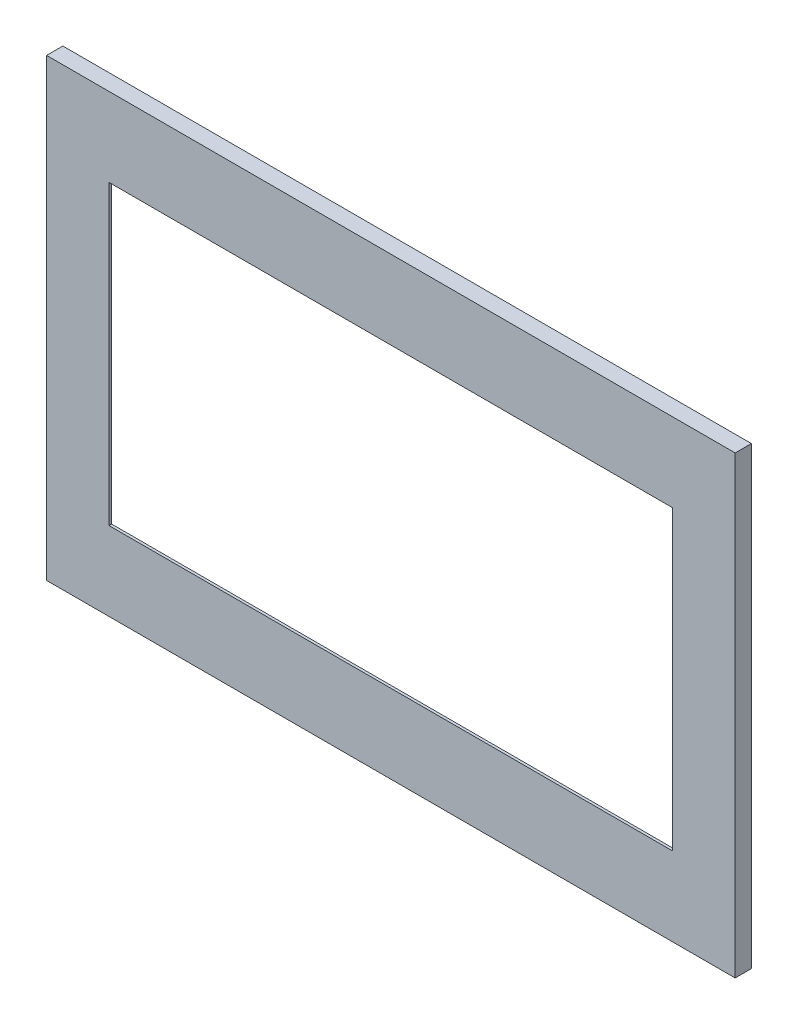
ISO-10303-21;
HEADER;
FILE_DESCRIPTION(('STEP AP214'),'2;1');
FILE_NAME('part.step','',(''),(''),'','','');
FILE_SCHEMA(('AUTOMOTIVE_DESIGN { 1 0 10303 214 1 1 1 1 }'));
ENDSEC;
DATA;
#1=APPLICATION_CONTEXT('core data for automotive mechanical design processes');
#2=APPLICATION_PROTOCOL_DEFINITION('international standard','automotive_design',2000,#1);
#3=PRODUCT_CONTEXT('',#1,'mechanical');
#4=PRODUCT('Part','Part','',(#3));
#5=PRODUCT_RELATED_PRODUCT_CATEGORY('part','',(#4));
#6=PRODUCT_DEFINITION_FORMATION('','',#4);
#7=PRODUCT_DEFINITION_CONTEXT('part definition',#1,'design');
#8=PRODUCT_DEFINITION('design','',#6,#7);
#9=PRODUCT_DEFINITION_SHAPE('','',#8);
#10=(LENGTH_UNIT() NAMED_UNIT(*) SI_UNIT(.MILLI.,.METRE.));
#11=(NAMED_UNIT(*) PLANE_ANGLE_UNIT() SI_UNIT($,.RADIAN.));
#12=(NAMED_UNIT(*) SI_UNIT($,.STERADIAN.) SOLID_ANGLE_UNIT());
#13=UNCERTAINTY_MEASURE_WITH_UNIT(LENGTH_MEASURE(1.E-05),#10,'distance_accuracy_value','');
#14=(GEOMETRIC_REPRESENTATION_CONTEXT(3) GLOBAL_UNCERTAINTY_ASSIGNED_CONTEXT((#13)) GLOBAL_UNIT_ASSIGNED_CONTEXT((#10,
#11,#12)) REPRESENTATION_CONTEXT('',''));
#15=CARTESIAN_POINT('',(0.,0.,0.));
#16=DIRECTION('',(0.,0.,1.));
#17=DIRECTION('',(1.,0.,0.));
#18=AXIS2_PLACEMENT_3D('',#15,#16,#17);
#19=CARTESIAN_POINT('',(-336.55,222.25,7.9375));
#20=DIRECTION('',(1.,0.,0.));
#21=DIRECTION('',(0.,1.,0.));
#22=AXIS2_PLACEMENT_3D('',#19,#20,#21);
#23=PLANE('',#22);
#24=DIRECTION('',(0.,-1.,0.));
#25=VECTOR('',#24,1.);
#26=CARTESIAN_POINT('',(-336.55,222.25,-7.9375));
#27=LINE('',#26,#25);
#28=CARTESIAN_POINT('',(-336.55,222.25,-7.9375));
#29=VERTEX_POINT('',#28);
#30=CARTESIAN_POINT('',(-336.55,-222.25,-7.9375));
#31=VERTEX_POINT('',#30);
#32=EDGE_CURVE('E186',#29,#31,#27,.T.);
#33=ORIENTED_EDGE('',*,*,#32,.T.);
#34=DIRECTION('',(0.,0.,-1.));
#35=VECTOR('',#34,1.);
#36=CARTESIAN_POINT('',(-336.55,-222.25,7.9375));
#37=LINE('',#36,#35);
#38=CARTESIAN_POINT('',(-336.55,-222.25,7.9375));
#39=VERTEX_POINT('',#38);
#40=EDGE_CURVE('E11',#39,#31,#37,.T.);
#41=ORIENTED_EDGE('',*,*,#40,.F.);
#42=DIRECTION('',(0.,-1.,0.));
#43=VECTOR('',#42,1.);
#44=CARTESIAN_POINT('',(-336.55,222.25,7.9375));
#45=LINE('',#44,#43);
#46=CARTESIAN_POINT('',(-336.55,222.25,7.9375));
#47=VERTEX_POINT('',#46);
#48=EDGE_CURVE('E194',#47,#39,#45,.T.);
#49=ORIENTED_EDGE('',*,*,#48,.F.);
#50=DIRECTION('',(0.,0.,-1.));
#51=VECTOR('',#50,1.);
#52=CARTESIAN_POINT('',(-336.55,222.25,7.9375));
#53=LINE('',#52,#51);
#54=EDGE_CURVE('E204',#47,#29,#53,.T.);
#55=ORIENTED_EDGE('',*,*,#54,.T.);
#56=EDGE_LOOP('',(#33,#41,#49,#55));
#57=FACE_BOUND('',#56,.T.);
#58=ADVANCED_FACE('F32',(#57),#23,.F.);
#59=CARTESIAN_POINT('',(336.55,-222.25,7.9375));
#60=DIRECTION('',(0.,1.,0.));
#61=DIRECTION('',(-1.,0.,0.));
#62=AXIS2_PLACEMENT_3D('',#59,#60,#61);
#63=PLANE('',#62);
#64=DIRECTION('',(1.,0.,0.));
#65=VECTOR('',#64,1.);
#66=CARTESIAN_POINT('',(336.55,-222.25,-7.9375));
#67=LINE('',#66,#65);
#68=CARTESIAN_POINT('',(336.55,-222.25,-7.9375));
#69=VERTEX_POINT('',#68);
#70=EDGE_CURVE('E207',#31,#69,#67,.T.);
#71=ORIENTED_EDGE('',*,*,#70,.T.);
#72=DIRECTION('',(0.,0.,-1.));
#73=VECTOR('',#72,1.);
#74=CARTESIAN_POINT('',(336.55,-222.25,7.9375));
#75=LINE('',#74,#73);
#76=CARTESIAN_POINT('',(336.55,-222.25,7.9375));
#77=VERTEX_POINT('',#76);
#78=EDGE_CURVE('E39',#77,#69,#75,.T.);
#79=ORIENTED_EDGE('',*,*,#78,.F.);
#80=DIRECTION('',(1.,0.,0.));
#81=VECTOR('',#80,1.);
#82=CARTESIAN_POINT('',(336.55,-222.25,7.9375));
#83=LINE('',#82,#81);
#84=EDGE_CURVE('E197',#39,#77,#83,.T.);
#85=ORIENTED_EDGE('',*,*,#84,.F.);
#86=ORIENTED_EDGE('',*,*,#40,.T.);
#87=EDGE_LOOP('',(#71,#79,#85,#86));
#88=FACE_BOUND('',#87,.T.);
#89=ADVANCED_FACE('F238',(#88),#63,.F.);
#90=CARTESIAN_POINT('',(336.55,222.25,7.9375));
#91=DIRECTION('',(-1.,0.,0.));
#92=DIRECTION('',(0.,-1.,0.));
#93=AXIS2_PLACEMENT_3D('',#90,#91,#92);
#94=PLANE('',#93);
#95=DIRECTION('',(0.,1.,0.));
#96=VECTOR('',#95,1.);
#97=CARTESIAN_POINT('',(336.55,222.25,-7.9375));
#98=LINE('',#97,#96);
#99=CARTESIAN_POINT('',(336.55,222.25,-7.9375));
#100=VERTEX_POINT('',#99);
#101=EDGE_CURVE('E209',#69,#100,#98,.T.);
#102=ORIENTED_EDGE('',*,*,#101,.T.);
#103=DIRECTION('',(0.,0.,-1.));
#104=VECTOR('',#103,1.);
#105=CARTESIAN_POINT('',(336.55,222.25,7.9375));
#106=LINE('',#105,#104);
#107=CARTESIAN_POINT('',(336.55,222.25,7.9375));
#108=VERTEX_POINT('',#107);
#109=EDGE_CURVE('E214',#108,#100,#106,.T.);
#110=ORIENTED_EDGE('',*,*,#109,.F.);
#111=DIRECTION('',(0.,1.,0.));
#112=VECTOR('',#111,1.);
#113=CARTESIAN_POINT('',(336.55,222.25,7.9375));
#114=LINE('',#113,#112);
#115=EDGE_CURVE('E200',#77,#108,#114,.T.);
#116=ORIENTED_EDGE('',*,*,#115,.F.);
#117=ORIENTED_EDGE('',*,*,#78,.T.);
#118=EDGE_LOOP('',(#102,#110,#116,#117));
#119=FACE_BOUND('',#118,.T.);
#120=ADVANCED_FACE('F221',(#119),#94,.F.);
#121=CARTESIAN_POINT('',(336.55,222.25,7.9375));
#122=DIRECTION('',(0.,-1.,0.));
#123=DIRECTION('',(1.,0.,0.));
#124=AXIS2_PLACEMENT_3D('',#121,#122,#123);
#125=PLANE('',#124);
#126=DIRECTION('',(-1.,0.,0.));
#127=VECTOR('',#126,1.);
#128=CARTESIAN_POINT('',(336.55,222.25,-7.9375));
#129=LINE('',#128,#127);
#130=EDGE_CURVE('E198',#100,#29,#129,.T.);
#131=ORIENTED_EDGE('',*,*,#130,.T.);
#132=ORIENTED_EDGE('',*,*,#54,.F.);
#133=DIRECTION('',(-1.,0.,0.));
#134=VECTOR('',#133,1.);
#135=CARTESIAN_POINT('',(336.55,222.25,7.9375));
#136=LINE('',#135,#134);
#137=EDGE_CURVE('E202',#108,#47,#136,.T.);
#138=ORIENTED_EDGE('',*,*,#137,.F.);
#139=ORIENTED_EDGE('',*,*,#109,.T.);
#140=EDGE_LOOP('',(#131,#132,#138,#139));
#141=FACE_BOUND('',#140,.T.);
#142=ADVANCED_FACE('F230',(#141),#125,.F.);
#143=CARTESIAN_POINT('',(0.,0.,7.9375));
#144=DIRECTION('',(0.,0.,-1.));
#145=DIRECTION('',(-1.,0.,0.));
#146=AXIS2_PLACEMENT_3D('',#143,#144,#145);
#147=PLANE('',#146);
#148=ORIENTED_EDGE('',*,*,#48,.T.);
#149=ORIENTED_EDGE('',*,*,#84,.T.);
#150=ORIENTED_EDGE('',*,*,#115,.T.);
#151=ORIENTED_EDGE('',*,*,#137,.T.);
#152=EDGE_LOOP('',(#148,#149,#150,#151));
#153=FACE_BOUND('',#152,.T.);
#154=DIRECTION('',(1.,0.,0.));
#155=VECTOR('',#154,1.);
#156=CARTESIAN_POINT('',(275.43125,-145.25625,7.9375));
#157=LINE('',#156,#155);
#158=CARTESIAN_POINT('',(-275.43125,-145.25625,7.9375));
#159=VERTEX_POINT('',#158);
#160=CARTESIAN_POINT('',(275.43125,-145.25625,7.9375));
#161=VERTEX_POINT('',#160);
#162=EDGE_CURVE('E154',#159,#161,#157,.T.);
#163=ORIENTED_EDGE('',*,*,#162,.F.);
#164=DIRECTION('',(0.,-1.,0.));
#165=VECTOR('',#164,1.);
#166=CARTESIAN_POINT('',(-275.43125,145.25625,7.9375));
#167=LINE('',#166,#165);
#168=CARTESIAN_POINT('',(-275.43125,145.25625,7.9375));
#169=VERTEX_POINT('',#168);
#170=EDGE_CURVE('E128',#169,#159,#167,.T.);
#171=ORIENTED_EDGE('',*,*,#170,.F.);
#172=DIRECTION('',(-1.,0.,0.));
#173=VECTOR('',#172,1.);
#174=CARTESIAN_POINT('',(275.43125,145.25625,7.9375));
#175=LINE('',#174,#173);
#176=CARTESIAN_POINT('',(275.43125,145.25625,7.9375));
#177=VERTEX_POINT('',#176);
#178=EDGE_CURVE('E145',#177,#169,#175,.T.);
#179=ORIENTED_EDGE('',*,*,#178,.F.);
#180=DIRECTION('',(0.,1.,0.));
#181=VECTOR('',#180,1.);
#182=CARTESIAN_POINT('',(275.43125,145.25625,7.9375));
#183=LINE('',#182,#181);
#184=EDGE_CURVE('E148',#161,#177,#183,.T.);
#185=ORIENTED_EDGE('',*,*,#184,.F.);
#186=EDGE_LOOP('',(#163,#171,#179,#185));
#187=FACE_BOUND('',#186,.T.);
#188=ADVANCED_FACE('F236',(#153,#187),#147,.F.);
#189=CARTESIAN_POINT('',(0.,0.,-7.9375));
#190=DIRECTION('',(0.,0.,-1.));
#191=DIRECTION('',(-1.,0.,0.));
#192=AXIS2_PLACEMENT_3D('',#189,#190,#191);
#193=PLANE('',#192);
#194=DIRECTION('',(0.,-1.,0.));
#195=VECTOR('',#194,1.);
#196=CARTESIAN_POINT('',(-300.83125,170.65625,-7.9375));
#197=LINE('',#196,#195);
#198=CARTESIAN_POINT('',(-300.83125,170.65625,-7.9375));
#199=VERTEX_POINT('',#198);
#200=CARTESIAN_POINT('',(-300.83125,-170.65625,-7.9375));
#201=VERTEX_POINT('',#200);
#202=EDGE_CURVE('E172',#199,#201,#197,.T.);
#203=ORIENTED_EDGE('',*,*,#202,.T.);
#204=DIRECTION('',(1.,0.,0.));
#205=VECTOR('',#204,1.);
#206=CARTESIAN_POINT('',(300.83125,-170.65625,-7.9375));
#207=LINE('',#206,#205);
#208=CARTESIAN_POINT('',(300.83125,-170.65625,-7.9375));
#209=VERTEX_POINT('',#208);
#210=EDGE_CURVE('E175',#201,#209,#207,.T.);
#211=ORIENTED_EDGE('',*,*,#210,.T.);
#212=DIRECTION('',(0.,1.,0.));
#213=VECTOR('',#212,1.);
#214=CARTESIAN_POINT('',(300.83125,170.65625,-7.9375));
#215=LINE('',#214,#213);
#216=CARTESIAN_POINT('',(300.83125,170.65625,-7.9375));
#217=VERTEX_POINT('',#216);
#218=EDGE_CURVE('E54',#209,#217,#215,.T.);
#219=ORIENTED_EDGE('',*,*,#218,.T.);
#220=DIRECTION('',(-1.,0.,0.));
#221=VECTOR('',#220,1.);
#222=CARTESIAN_POINT('',(300.83125,170.65625,-7.9375));
#223=LINE('',#222,#221);
#224=EDGE_CURVE('E179',#217,#199,#223,.T.);
#225=ORIENTED_EDGE('',*,*,#224,.T.);
#226=EDGE_LOOP('',(#203,#211,#219,#225));
#227=FACE_BOUND('',#226,.T.);
#228=ORIENTED_EDGE('',*,*,#32,.F.);
#229=ORIENTED_EDGE('',*,*,#130,.F.);
#230=ORIENTED_EDGE('',*,*,#101,.F.);
#231=ORIENTED_EDGE('',*,*,#70,.F.);
#232=EDGE_LOOP('',(#228,#229,#230,#231));
#233=FACE_BOUND('',#232,.T.);
#234=ADVANCED_FACE('F227',(#227,#233),#193,.T.);
#235=CARTESIAN_POINT('',(-300.83125,170.65625,-7.9375));
#236=DIRECTION('',(-1.,0.,0.));
#237=DIRECTION('',(0.,0.,1.));
#238=AXIS2_PLACEMENT_3D('',#235,#236,#237);
#239=PLANE('',#238);
#240=DIRECTION('',(0.,0.,1.));
#241=VECTOR('',#240,1.);
#242=CARTESIAN_POINT('',(-300.83125,170.65625,-7.9375));
#243=LINE('',#242,#241);
#244=CARTESIAN_POINT('',(-300.83125,170.65625,5.3975));
#245=VERTEX_POINT('',#244);
#246=EDGE_CURVE('E183',#199,#245,#243,.T.);
#247=ORIENTED_EDGE('',*,*,#246,.T.);
#248=DIRECTION('',(0.,-1.,0.));
#249=VECTOR('',#248,1.);
#250=CARTESIAN_POINT('',(-300.83125,170.65625,5.3975));
#251=LINE('',#250,#249);
#252=CARTESIAN_POINT('',(-300.83125,-170.65625,5.3975));
#253=VERTEX_POINT('',#252);
#254=EDGE_CURVE('E160',#245,#253,#251,.T.);
#255=ORIENTED_EDGE('',*,*,#254,.T.);
#256=DIRECTION('',(0.,0.,1.));
#257=VECTOR('',#256,1.);
#258=CARTESIAN_POINT('',(-300.83125,-170.65625,-7.9375));
#259=LINE('',#258,#257);
#260=EDGE_CURVE('E182',#201,#253,#259,.T.);
#261=ORIENTED_EDGE('',*,*,#260,.F.);
#262=ORIENTED_EDGE('',*,*,#202,.F.);
#263=EDGE_LOOP('',(#247,#255,#261,#262));
#264=FACE_BOUND('',#263,.T.);
#265=ADVANCED_FACE('F250',(#264),#239,.F.);
#266=CARTESIAN_POINT('',(300.83125,170.65625,-7.9375));
#267=DIRECTION('',(0.,1.,0.));
#268=DIRECTION('',(-1.,0.,0.));
#269=AXIS2_PLACEMENT_3D('',#266,#267,#268);
#270=PLANE('',#269);
#271=DIRECTION('',(0.,0.,1.));
#272=VECTOR('',#271,1.);
#273=CARTESIAN_POINT('',(300.83125,170.65625,-7.9375));
#274=LINE('',#273,#272);
#275=CARTESIAN_POINT('',(300.83125,170.65625,5.3975));
#276=VERTEX_POINT('',#275);
#277=EDGE_CURVE('E187',#217,#276,#274,.T.);
#278=ORIENTED_EDGE('',*,*,#277,.T.);
#279=DIRECTION('',(-1.,0.,0.));
#280=VECTOR('',#279,1.);
#281=CARTESIAN_POINT('',(300.83125,170.65625,5.3975));
#282=LINE('',#281,#280);
#283=EDGE_CURVE('E169',#276,#245,#282,.T.);
#284=ORIENTED_EDGE('',*,*,#283,.T.);
#285=ORIENTED_EDGE('',*,*,#246,.F.);
#286=ORIENTED_EDGE('',*,*,#224,.F.);
#287=EDGE_LOOP('',(#278,#284,#285,#286));
#288=FACE_BOUND('',#287,.T.);
#289=ADVANCED_FACE('F256',(#288),#270,.F.);
#290=CARTESIAN_POINT('',(300.83125,170.65625,-7.9375));
#291=DIRECTION('',(1.,0.,0.));
#292=DIRECTION('',(0.,1.,0.));
#293=AXIS2_PLACEMENT_3D('',#290,#291,#292);
#294=PLANE('',#293);
#295=DIRECTION('',(0.,0.,1.));
#296=VECTOR('',#295,1.);
#297=CARTESIAN_POINT('',(300.83125,-170.65625,-7.9375));
#298=LINE('',#297,#296);
#299=CARTESIAN_POINT('',(300.83125,-170.65625,5.3975));
#300=VERTEX_POINT('',#299);
#301=EDGE_CURVE('E190',#209,#300,#298,.T.);
#302=ORIENTED_EDGE('',*,*,#301,.T.);
#303=DIRECTION('',(0.,1.,0.));
#304=VECTOR('',#303,1.);
#305=CARTESIAN_POINT('',(300.83125,170.65625,5.3975));
#306=LINE('',#305,#304);
#307=EDGE_CURVE('E46',#300,#276,#306,.T.);
#308=ORIENTED_EDGE('',*,*,#307,.T.);
#309=ORIENTED_EDGE('',*,*,#277,.F.);
#310=ORIENTED_EDGE('',*,*,#218,.F.);
#311=EDGE_LOOP('',(#302,#308,#309,#310));
#312=FACE_BOUND('',#311,.T.);
#313=ADVANCED_FACE('F261',(#312),#294,.F.);
#314=CARTESIAN_POINT('',(300.83125,-170.65625,-7.9375));
#315=DIRECTION('',(0.,-1.,0.));
#316=DIRECTION('',(1.,0.,0.));
#317=AXIS2_PLACEMENT_3D('',#314,#315,#316);
#318=PLANE('',#317);
#319=ORIENTED_EDGE('',*,*,#260,.T.);
#320=DIRECTION('',(1.,0.,0.));
#321=VECTOR('',#320,1.);
#322=CARTESIAN_POINT('',(300.83125,-170.65625,5.3975));
#323=LINE('',#322,#321);
#324=EDGE_CURVE('E166',#253,#300,#323,.T.);
#325=ORIENTED_EDGE('',*,*,#324,.T.);
#326=ORIENTED_EDGE('',*,*,#301,.F.);
#327=ORIENTED_EDGE('',*,*,#210,.F.);
#328=EDGE_LOOP('',(#319,#325,#326,#327));
#329=FACE_BOUND('',#328,.T.);
#330=ADVANCED_FACE('F258',(#329),#318,.F.);
#331=CARTESIAN_POINT('',(0.,0.,5.3975));
#332=DIRECTION('',(0.,0.,-1.));
#333=DIRECTION('',(-1.,0.,0.));
#334=AXIS2_PLACEMENT_3D('',#331,#332,#333);
#335=PLANE('',#334);
#336=DIRECTION('',(0.,-1.,0.));
#337=VECTOR('',#336,1.);
#338=CARTESIAN_POINT('',(-275.43125,145.25625,5.3975));
#339=LINE('',#338,#337);
#340=CARTESIAN_POINT('',(-275.43125,145.25625,5.3975));
#341=VERTEX_POINT('',#340);
#342=CARTESIAN_POINT('',(-275.43125,-145.25625,5.3975));
#343=VERTEX_POINT('',#342);
#344=EDGE_CURVE('E125',#341,#343,#339,.T.);
#345=ORIENTED_EDGE('',*,*,#344,.T.);
#346=DIRECTION('',(1.,0.,0.));
#347=VECTOR('',#346,1.);
#348=CARTESIAN_POINT('',(275.43125,-145.25625,5.3975));
#349=LINE('',#348,#347);
#350=CARTESIAN_POINT('',(275.43125,-145.25625,5.3975));
#351=VERTEX_POINT('',#350);
#352=EDGE_CURVE('E137',#343,#351,#349,.T.);
#353=ORIENTED_EDGE('',*,*,#352,.T.);
#354=DIRECTION('',(0.,1.,0.));
#355=VECTOR('',#354,1.);
#356=CARTESIAN_POINT('',(275.43125,145.25625,5.3975));
#357=LINE('',#356,#355);
#358=CARTESIAN_POINT('',(275.43125,145.25625,5.3975));
#359=VERTEX_POINT('',#358);
#360=EDGE_CURVE('E141',#351,#359,#357,.T.);
#361=ORIENTED_EDGE('',*,*,#360,.T.);
#362=DIRECTION('',(-1.,0.,0.));
#363=VECTOR('',#362,1.);
#364=CARTESIAN_POINT('',(275.43125,145.25625,5.3975));
#365=LINE('',#364,#363);
#366=EDGE_CURVE('E133',#359,#341,#365,.T.);
#367=ORIENTED_EDGE('',*,*,#366,.T.);
#368=EDGE_LOOP('',(#345,#353,#361,#367));
#369=FACE_BOUND('',#368,.T.);
#370=ORIENTED_EDGE('',*,*,#254,.F.);
#371=ORIENTED_EDGE('',*,*,#283,.F.);
#372=ORIENTED_EDGE('',*,*,#307,.F.);
#373=ORIENTED_EDGE('',*,*,#324,.F.);
#374=EDGE_LOOP('',(#370,#371,#372,#373));
#375=FACE_BOUND('',#374,.T.);
#376=ADVANCED_FACE('F143',(#369,#375),#335,.T.);
#377=CARTESIAN_POINT('',(-275.43125,145.25625,5.3975));
#378=DIRECTION('',(-1.,0.,0.));
#379=DIRECTION('',(0.,-1.,0.));
#380=AXIS2_PLACEMENT_3D('',#377,#378,#379);
#381=PLANE('',#380);
#382=ORIENTED_EDGE('',*,*,#170,.T.);
#383=DIRECTION('',(0.,0.,1.));
#384=VECTOR('',#383,1.);
#385=CARTESIAN_POINT('',(-275.43125,-145.25625,5.3975));
#386=LINE('',#385,#384);
#387=EDGE_CURVE('E121',#343,#159,#386,.T.);
#388=ORIENTED_EDGE('',*,*,#387,.F.);
#389=ORIENTED_EDGE('',*,*,#344,.F.);
#390=DIRECTION('',(0.,0.,1.));
#391=VECTOR('',#390,1.);
#392=CARTESIAN_POINT('',(-275.43125,145.25625,5.3975));
#393=LINE('',#392,#391);
#394=EDGE_CURVE('E158',#341,#169,#393,.T.);
#395=ORIENTED_EDGE('',*,*,#394,.T.);
#396=EDGE_LOOP('',(#382,#388,#389,#395));
#397=FACE_BOUND('',#396,.T.);
#398=ADVANCED_FACE('F123',(#397),#381,.F.);
#399=CARTESIAN_POINT('',(275.43125,145.25625,5.3975));
#400=DIRECTION('',(0.,1.,0.));
#401=DIRECTION('',(-1.,0.,0.));
#402=AXIS2_PLACEMENT_3D('',#399,#400,#401);
#403=PLANE('',#402);
#404=ORIENTED_EDGE('',*,*,#178,.T.);
#405=ORIENTED_EDGE('',*,*,#394,.F.);
#406=ORIENTED_EDGE('',*,*,#366,.F.);
#407=DIRECTION('',(0.,0.,1.));
#408=VECTOR('',#407,1.);
#409=CARTESIAN_POINT('',(275.43125,145.25625,5.3975));
#410=LINE('',#409,#408);
#411=EDGE_CURVE('E161',#359,#177,#410,.T.);
#412=ORIENTED_EDGE('',*,*,#411,.T.);
#413=EDGE_LOOP('',(#404,#405,#406,#412));
#414=FACE_BOUND('',#413,.T.);
#415=ADVANCED_FACE('F272',(#414),#403,.F.);
#416=CARTESIAN_POINT('',(275.43125,145.25625,5.3975));
#417=DIRECTION('',(1.,0.,0.));
#418=DIRECTION('',(0.,1.,0.));
#419=AXIS2_PLACEMENT_3D('',#416,#417,#418);
#420=PLANE('',#419);
#421=ORIENTED_EDGE('',*,*,#184,.T.);
#422=ORIENTED_EDGE('',*,*,#411,.F.);
#423=ORIENTED_EDGE('',*,*,#360,.F.);
#424=DIRECTION('',(0.,0.,1.));
#425=VECTOR('',#424,1.);
#426=CARTESIAN_POINT('',(275.43125,-145.25625,5.3975));
#427=LINE('',#426,#425);
#428=EDGE_CURVE('E132',#351,#161,#427,.T.);
#429=ORIENTED_EDGE('',*,*,#428,.T.);
#430=EDGE_LOOP('',(#421,#422,#423,#429));
#431=FACE_BOUND('',#430,.T.);
#432=ADVANCED_FACE('F275',(#431),#420,.F.);
#433=CARTESIAN_POINT('',(275.43125,-145.25625,5.3975));
#434=DIRECTION('',(0.,-1.,0.));
#435=DIRECTION('',(1.,0.,0.));
#436=AXIS2_PLACEMENT_3D('',#433,#434,#435);
#437=PLANE('',#436);
#438=ORIENTED_EDGE('',*,*,#162,.T.);
#439=ORIENTED_EDGE('',*,*,#428,.F.);
#440=ORIENTED_EDGE('',*,*,#352,.F.);
#441=ORIENTED_EDGE('',*,*,#387,.T.);
#442=EDGE_LOOP('',(#438,#439,#440,#441));
#443=FACE_BOUND('',#442,.T.);
#444=ADVANCED_FACE('F138',(#443),#437,.F.);
#445=CLOSED_SHELL('',(#58,#89,#120,#142,#188,#234,#265,#289,#313,#330,#376,#398,#415,#432,#444));
#446=MANIFOLD_SOLID_BREP('B2',#445);
#447=ADVANCED_BREP_SHAPE_REPRESENTATION('',(#18,#446),#14);
#448=SHAPE_DEFINITION_REPRESENTATION(#9,#447);
ENDSEC;
END-ISO-10303-21;
